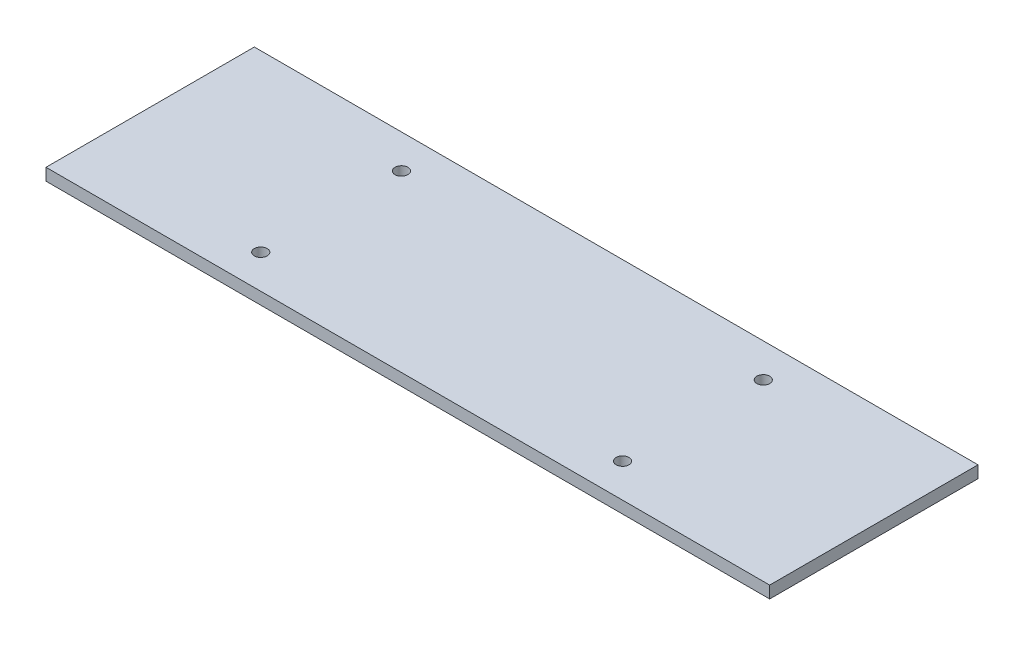
ISO-10303-21;
HEADER;
FILE_DESCRIPTION(('STEP AP214'),'2;1');
FILE_NAME('part.step','',(''),(''),'','','');
FILE_SCHEMA(('AUTOMOTIVE_DESIGN { 1 0 10303 214 1 1 1 1 }'));
ENDSEC;
DATA;
#1=APPLICATION_CONTEXT('core data for automotive mechanical design processes');
#2=APPLICATION_PROTOCOL_DEFINITION('international standard','automotive_design',2000,#1);
#3=PRODUCT_CONTEXT('',#1,'mechanical');
#4=PRODUCT('Part','Part','',(#3));
#5=PRODUCT_RELATED_PRODUCT_CATEGORY('part','',(#4));
#6=PRODUCT_DEFINITION_FORMATION('','',#4);
#7=PRODUCT_DEFINITION_CONTEXT('part definition',#1,'design');
#8=PRODUCT_DEFINITION('design','',#6,#7);
#9=PRODUCT_DEFINITION_SHAPE('','',#8);
#10=(LENGTH_UNIT() NAMED_UNIT(*) SI_UNIT(.MILLI.,.METRE.));
#11=(NAMED_UNIT(*) PLANE_ANGLE_UNIT() SI_UNIT($,.RADIAN.));
#12=(NAMED_UNIT(*) SI_UNIT($,.STERADIAN.) SOLID_ANGLE_UNIT());
#13=UNCERTAINTY_MEASURE_WITH_UNIT(LENGTH_MEASURE(1.E-05),#10,'distance_accuracy_value','');
#14=(GEOMETRIC_REPRESENTATION_CONTEXT(3) GLOBAL_UNCERTAINTY_ASSIGNED_CONTEXT((#13)) GLOBAL_UNIT_ASSIGNED_CONTEXT((#10,
#11,#12)) REPRESENTATION_CONTEXT('',''));
#15=CARTESIAN_POINT('',(0.,0.,0.));
#16=DIRECTION('',(0.,0.,1.));
#17=DIRECTION('',(1.,0.,0.));
#18=AXIS2_PLACEMENT_3D('',#15,#16,#17);
#19=CARTESIAN_POINT('',(116.592178535022,3.,0.));
#20=DIRECTION('',(1.,0.,0.));
#21=DIRECTION('',(0.,0.,-1.));
#22=AXIS2_PLACEMENT_3D('',#19,#20,#21);
#23=PLANE('',#22);
#24=DIRECTION('',(0.,0.,1.));
#25=VECTOR('',#24,1.);
#26=CARTESIAN_POINT('',(116.592178535022,0.,0.));
#27=LINE('',#26,#25);
#28=CARTESIAN_POINT('',(116.592178535022,0.,-26.6263036746763));
#29=VERTEX_POINT('',#28);
#30=CARTESIAN_POINT('',(116.592178535022,0.,25.1936963253237));
#31=VERTEX_POINT('',#30);
#32=EDGE_CURVE('E99',#29,#31,#27,.T.);
#33=ORIENTED_EDGE('',*,*,#32,.F.);
#34=DIRECTION('',(0.,-1.,0.));
#35=VECTOR('',#34,1.);
#36=CARTESIAN_POINT('',(116.592178535022,3.,-26.6263036746763));
#37=LINE('',#36,#35);
#38=CARTESIAN_POINT('',(116.592178535022,3.,-26.6263036746763));
#39=VERTEX_POINT('',#38);
#40=EDGE_CURVE('E11',#39,#29,#37,.T.);
#41=ORIENTED_EDGE('',*,*,#40,.F.);
#42=DIRECTION('',(0.,0.,1.));
#43=VECTOR('',#42,1.);
#44=CARTESIAN_POINT('',(116.592178535022,3.,0.));
#45=LINE('',#44,#43);
#46=CARTESIAN_POINT('',(116.592178535022,3.,25.1936963253237));
#47=VERTEX_POINT('',#46);
#48=EDGE_CURVE('E92',#39,#47,#45,.T.);
#49=ORIENTED_EDGE('',*,*,#48,.T.);
#50=DIRECTION('',(0.,-1.,0.));
#51=VECTOR('',#50,1.);
#52=CARTESIAN_POINT('',(116.592178535022,3.,25.1936963253237));
#53=LINE('',#52,#51);
#54=EDGE_CURVE('E73',#47,#31,#53,.T.);
#55=ORIENTED_EDGE('',*,*,#54,.T.);
#56=EDGE_LOOP('',(#33,#41,#49,#55));
#57=FACE_BOUND('',#56,.T.);
#58=ADVANCED_FACE('F35',(#57),#23,.T.);
#59=CARTESIAN_POINT('',(0.,3.,-26.6263036746763));
#60=DIRECTION('',(0.,0.,-1.));
#61=DIRECTION('',(-1.,0.,0.));
#62=AXIS2_PLACEMENT_3D('',#59,#60,#61);
#63=PLANE('',#62);
#64=DIRECTION('',(1.,0.,0.));
#65=VECTOR('',#64,1.);
#66=CARTESIAN_POINT('',(0.,0.,-26.6263036746763));
#67=LINE('',#66,#65);
#68=CARTESIAN_POINT('',(-63.4078214649779,0.,-26.6263036746763));
#69=VERTEX_POINT('',#68);
#70=EDGE_CURVE('E86',#69,#29,#67,.T.);
#71=ORIENTED_EDGE('',*,*,#70,.F.);
#72=DIRECTION('',(0.,-1.,0.));
#73=VECTOR('',#72,1.);
#74=CARTESIAN_POINT('',(-63.4078214649779,3.,-26.6263036746763));
#75=LINE('',#74,#73);
#76=CARTESIAN_POINT('',(-63.4078214649779,3.,-26.6263036746763));
#77=VERTEX_POINT('',#76);
#78=EDGE_CURVE('E43',#77,#69,#75,.T.);
#79=ORIENTED_EDGE('',*,*,#78,.F.);
#80=DIRECTION('',(1.,0.,0.));
#81=VECTOR('',#80,1.);
#82=CARTESIAN_POINT('',(0.,3.,-26.6263036746763));
#83=LINE('',#82,#81);
#84=EDGE_CURVE('E84',#77,#39,#83,.T.);
#85=ORIENTED_EDGE('',*,*,#84,.T.);
#86=ORIENTED_EDGE('',*,*,#40,.T.);
#87=EDGE_LOOP('',(#71,#79,#85,#86));
#88=FACE_BOUND('',#87,.T.);
#89=ADVANCED_FACE('F82',(#88),#63,.T.);
#90=CARTESIAN_POINT('',(-63.4078214649779,3.,0.));
#91=DIRECTION('',(1.,0.,0.));
#92=DIRECTION('',(0.,0.,-1.));
#93=AXIS2_PLACEMENT_3D('',#90,#91,#92);
#94=PLANE('',#93);
#95=DIRECTION('',(0.,0.,1.));
#96=VECTOR('',#95,1.);
#97=CARTESIAN_POINT('',(-63.4078214649779,0.,0.));
#98=LINE('',#97,#96);
#99=CARTESIAN_POINT('',(-63.4078214649779,0.,25.1936963253237));
#100=VERTEX_POINT('',#99);
#101=EDGE_CURVE('E66',#69,#100,#98,.T.);
#102=ORIENTED_EDGE('',*,*,#101,.T.);
#103=DIRECTION('',(0.,-1.,0.));
#104=VECTOR('',#103,1.);
#105=CARTESIAN_POINT('',(-63.4078214649779,3.,25.1936963253237));
#106=LINE('',#105,#104);
#107=CARTESIAN_POINT('',(-63.4078214649779,3.,25.1936963253237));
#108=VERTEX_POINT('',#107);
#109=EDGE_CURVE('E87',#108,#100,#106,.T.);
#110=ORIENTED_EDGE('',*,*,#109,.F.);
#111=DIRECTION('',(0.,0.,1.));
#112=VECTOR('',#111,1.);
#113=CARTESIAN_POINT('',(-63.4078214649779,3.,0.));
#114=LINE('',#113,#112);
#115=EDGE_CURVE('E88',#77,#108,#114,.T.);
#116=ORIENTED_EDGE('',*,*,#115,.F.);
#117=ORIENTED_EDGE('',*,*,#78,.T.);
#118=EDGE_LOOP('',(#102,#110,#116,#117));
#119=FACE_BOUND('',#118,.T.);
#120=ADVANCED_FACE('F89',(#119),#94,.F.);
#121=CARTESIAN_POINT('',(0.,3.,25.1936963253237));
#122=DIRECTION('',(0.,0.,-1.));
#123=DIRECTION('',(-1.,0.,0.));
#124=AXIS2_PLACEMENT_3D('',#121,#122,#123);
#125=PLANE('',#124);
#126=DIRECTION('',(1.,0.,0.));
#127=VECTOR('',#126,1.);
#128=CARTESIAN_POINT('',(0.,0.,25.1936963253237));
#129=LINE('',#128,#127);
#130=EDGE_CURVE('E94',#100,#31,#129,.T.);
#131=ORIENTED_EDGE('',*,*,#130,.T.);
#132=ORIENTED_EDGE('',*,*,#54,.F.);
#133=DIRECTION('',(1.,0.,0.));
#134=VECTOR('',#133,1.);
#135=CARTESIAN_POINT('',(0.,3.,25.1936963253237));
#136=LINE('',#135,#134);
#137=EDGE_CURVE('E51',#108,#47,#136,.T.);
#138=ORIENTED_EDGE('',*,*,#137,.F.);
#139=ORIENTED_EDGE('',*,*,#109,.T.);
#140=EDGE_LOOP('',(#131,#132,#138,#139));
#141=FACE_BOUND('',#140,.T.);
#142=ADVANCED_FACE('F109',(#141),#125,.F.);
#143=CARTESIAN_POINT('',(0.,3.,0.));
#144=DIRECTION('',(0.,1.,0.));
#145=DIRECTION('',(0.,0.,1.));
#146=AXIS2_PLACEMENT_3D('',#143,#144,#145);
#147=PLANE('',#146);
#148=CARTESIAN_POINT('',(-18.4078214649779,3.,16.7836963253237));
#149=DIRECTION('',(0.,1.,0.));
#150=DIRECTION('',(0.,0.,1.));
#151=AXIS2_PLACEMENT_3D('',#148,#149,#150);
#152=CIRCLE('',#151,1.6);
#153=CARTESIAN_POINT('',(-18.4078214649779,3.,18.3836963253237));
#154=VERTEX_POINT('',#153);
#155=EDGE_CURVE('E152',#154,#154,#152,.T.);
#156=ORIENTED_EDGE('',*,*,#155,.F.);
#157=EDGE_LOOP('',(#156));
#158=FACE_BOUND('',#157,.T.);
#159=CARTESIAN_POINT('',(71.592178535022,3.,16.7836963253237));
#160=DIRECTION('',(0.,1.,0.));
#161=DIRECTION('',(0.,0.,1.));
#162=AXIS2_PLACEMENT_3D('',#159,#160,#161);
#163=CIRCLE('',#162,1.6);
#164=CARTESIAN_POINT('',(71.592178535022,3.,18.3836963253237));
#165=VERTEX_POINT('',#164);
#166=EDGE_CURVE('E154',#165,#165,#163,.T.);
#167=ORIENTED_EDGE('',*,*,#166,.F.);
#168=EDGE_LOOP('',(#167));
#169=FACE_BOUND('',#168,.T.);
#170=CARTESIAN_POINT('',(71.592178535022,3.,-18.2163036746763));
#171=DIRECTION('',(0.,1.,0.));
#172=DIRECTION('',(0.,0.,1.));
#173=AXIS2_PLACEMENT_3D('',#170,#171,#172);
#174=CIRCLE('',#173,1.6);
#175=CARTESIAN_POINT('',(71.592178535022,3.,-16.6163036746763));
#176=VERTEX_POINT('',#175);
#177=EDGE_CURVE('E160',#176,#176,#174,.T.);
#178=ORIENTED_EDGE('',*,*,#177,.F.);
#179=EDGE_LOOP('',(#178));
#180=FACE_BOUND('',#179,.T.);
#181=CARTESIAN_POINT('',(-18.4078214649779,3.,-18.2163036746763));
#182=DIRECTION('',(0.,1.,0.));
#183=DIRECTION('',(0.,0.,1.));
#184=AXIS2_PLACEMENT_3D('',#181,#182,#183);
#185=CIRCLE('',#184,1.6);
#186=CARTESIAN_POINT('',(-18.4078214649779,3.,-16.6163036746763));
#187=VERTEX_POINT('',#186);
#188=EDGE_CURVE('E166',#187,#187,#185,.T.);
#189=ORIENTED_EDGE('',*,*,#188,.F.);
#190=EDGE_LOOP('',(#189));
#191=FACE_BOUND('',#190,.T.);
#192=ORIENTED_EDGE('',*,*,#48,.F.);
#193=ORIENTED_EDGE('',*,*,#84,.F.);
#194=ORIENTED_EDGE('',*,*,#115,.T.);
#195=ORIENTED_EDGE('',*,*,#137,.T.);
#196=EDGE_LOOP('',(#192,#193,#194,#195));
#197=FACE_BOUND('',#196,.T.);
#198=ADVANCED_FACE('F91',(#158,#169,#180,#191,#197),#147,.T.);
#199=CARTESIAN_POINT('',(0.,0.,0.));
#200=DIRECTION('',(0.,1.,0.));
#201=DIRECTION('',(0.,0.,1.));
#202=AXIS2_PLACEMENT_3D('',#199,#200,#201);
#203=PLANE('',#202);
#204=CARTESIAN_POINT('',(-18.4078214649779,0.,16.7836963253237));
#205=DIRECTION('',(0.,1.,0.));
#206=DIRECTION('',(0.,0.,1.));
#207=AXIS2_PLACEMENT_3D('',#204,#205,#206);
#208=CIRCLE('',#207,1.6);
#209=CARTESIAN_POINT('',(-18.4078214649779,0.,18.3836963253237));
#210=VERTEX_POINT('',#209);
#211=EDGE_CURVE('E149',#210,#210,#208,.T.);
#212=ORIENTED_EDGE('',*,*,#211,.T.);
#213=EDGE_LOOP('',(#212));
#214=FACE_BOUND('',#213,.T.);
#215=CARTESIAN_POINT('',(71.592178535022,0.,16.7836963253237));
#216=DIRECTION('',(0.,1.,0.));
#217=DIRECTION('',(0.,0.,1.));
#218=AXIS2_PLACEMENT_3D('',#215,#216,#217);
#219=CIRCLE('',#218,1.6);
#220=CARTESIAN_POINT('',(71.592178535022,0.,18.3836963253237));
#221=VERTEX_POINT('',#220);
#222=EDGE_CURVE('E157',#221,#221,#219,.T.);
#223=ORIENTED_EDGE('',*,*,#222,.T.);
#224=EDGE_LOOP('',(#223));
#225=FACE_BOUND('',#224,.T.);
#226=CARTESIAN_POINT('',(71.592178535022,0.,-18.2163036746763));
#227=DIRECTION('',(0.,1.,0.));
#228=DIRECTION('',(0.,0.,1.));
#229=AXIS2_PLACEMENT_3D('',#226,#227,#228);
#230=CIRCLE('',#229,1.6);
#231=CARTESIAN_POINT('',(71.592178535022,0.,-16.6163036746763));
#232=VERTEX_POINT('',#231);
#233=EDGE_CURVE('E163',#232,#232,#230,.T.);
#234=ORIENTED_EDGE('',*,*,#233,.T.);
#235=EDGE_LOOP('',(#234));
#236=FACE_BOUND('',#235,.T.);
#237=CARTESIAN_POINT('',(-18.4078214649779,0.,-18.2163036746763));
#238=DIRECTION('',(0.,1.,0.));
#239=DIRECTION('',(0.,0.,1.));
#240=AXIS2_PLACEMENT_3D('',#237,#238,#239);
#241=CIRCLE('',#240,1.6);
#242=CARTESIAN_POINT('',(-18.4078214649779,0.,-16.6163036746763));
#243=VERTEX_POINT('',#242);
#244=EDGE_CURVE('E102',#243,#243,#241,.T.);
#245=ORIENTED_EDGE('',*,*,#244,.T.);
#246=EDGE_LOOP('',(#245));
#247=FACE_BOUND('',#246,.T.);
#248=ORIENTED_EDGE('',*,*,#32,.T.);
#249=ORIENTED_EDGE('',*,*,#130,.F.);
#250=ORIENTED_EDGE('',*,*,#101,.F.);
#251=ORIENTED_EDGE('',*,*,#70,.T.);
#252=EDGE_LOOP('',(#248,#249,#250,#251));
#253=FACE_BOUND('',#252,.T.);
#254=ADVANCED_FACE('F111',(#214,#225,#236,#247,#253),#203,.F.);
#255=CARTESIAN_POINT('',(-18.4078214649779,0.,-18.2163036746763));
#256=DIRECTION('',(0.,1.,0.));
#257=DIRECTION('',(0.,0.,1.));
#258=AXIS2_PLACEMENT_3D('',#255,#256,#257);
#259=CYLINDRICAL_SURFACE('',#258,1.6);
#260=ORIENTED_EDGE('',*,*,#244,.F.);
#261=EDGE_LOOP('',(#260));
#262=FACE_BOUND('',#261,.T.);
#263=ORIENTED_EDGE('',*,*,#188,.T.);
#264=EDGE_LOOP('',(#263));
#265=FACE_BOUND('',#264,.T.);
#266=ADVANCED_FACE('F125',(#262,#265),#259,.F.);
#267=CARTESIAN_POINT('',(71.592178535022,0.,-18.2163036746763));
#268=DIRECTION('',(0.,1.,0.));
#269=DIRECTION('',(0.,0.,1.));
#270=AXIS2_PLACEMENT_3D('',#267,#268,#269);
#271=CYLINDRICAL_SURFACE('',#270,1.6);
#272=ORIENTED_EDGE('',*,*,#233,.F.);
#273=EDGE_LOOP('',(#272));
#274=FACE_BOUND('',#273,.T.);
#275=ORIENTED_EDGE('',*,*,#177,.T.);
#276=EDGE_LOOP('',(#275));
#277=FACE_BOUND('',#276,.T.);
#278=ADVANCED_FACE('F132',(#274,#277),#271,.F.);
#279=CARTESIAN_POINT('',(71.592178535022,0.,16.7836963253237));
#280=DIRECTION('',(0.,1.,0.));
#281=DIRECTION('',(0.,0.,1.));
#282=AXIS2_PLACEMENT_3D('',#279,#280,#281);
#283=CYLINDRICAL_SURFACE('',#282,1.6);
#284=ORIENTED_EDGE('',*,*,#222,.F.);
#285=EDGE_LOOP('',(#284));
#286=FACE_BOUND('',#285,.T.);
#287=ORIENTED_EDGE('',*,*,#166,.T.);
#288=EDGE_LOOP('',(#287));
#289=FACE_BOUND('',#288,.T.);
#290=ADVANCED_FACE('F136',(#286,#289),#283,.F.);
#291=CARTESIAN_POINT('',(-18.4078214649779,0.,16.7836963253237));
#292=DIRECTION('',(0.,1.,0.));
#293=DIRECTION('',(0.,0.,1.));
#294=AXIS2_PLACEMENT_3D('',#291,#292,#293);
#295=CYLINDRICAL_SURFACE('',#294,1.6);
#296=ORIENTED_EDGE('',*,*,#211,.F.);
#297=EDGE_LOOP('',(#296));
#298=FACE_BOUND('',#297,.T.);
#299=ORIENTED_EDGE('',*,*,#155,.T.);
#300=EDGE_LOOP('',(#299));
#301=FACE_BOUND('',#300,.T.);
#302=ADVANCED_FACE('F140',(#298,#301),#295,.F.);
#303=CLOSED_SHELL('',(#58,#89,#120,#142,#198,#254,#266,#278,#290,#302));
#304=MANIFOLD_SOLID_BREP('B2',#303);
#305=ADVANCED_BREP_SHAPE_REPRESENTATION('',(#18,#304),#14);
#306=SHAPE_DEFINITION_REPRESENTATION(#9,#305);
ENDSEC;
END-ISO-10303-21;
